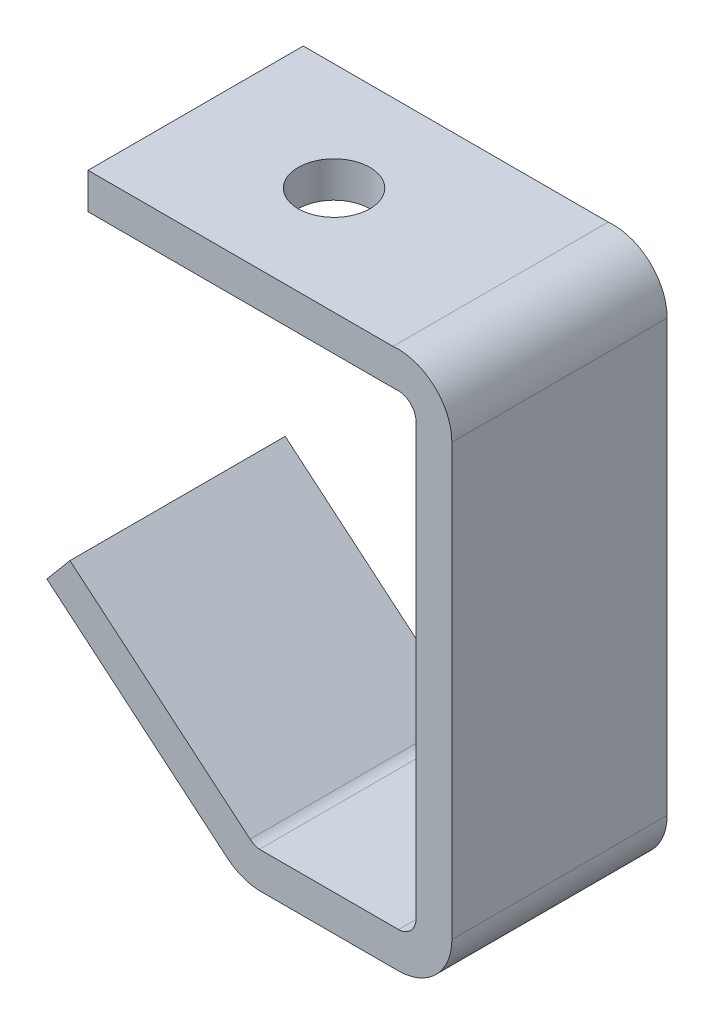
ISO-10303-21;
HEADER;
FILE_DESCRIPTION(('STEP AP214'),'2;1');
FILE_NAME('part.step','',(''),(''),'','','');
FILE_SCHEMA(('AUTOMOTIVE_DESIGN { 1 0 10303 214 1 1 1 1 }'));
ENDSEC;
DATA;
#1=APPLICATION_CONTEXT('core data for automotive mechanical design processes');
#2=APPLICATION_PROTOCOL_DEFINITION('international standard','automotive_design',2000,#1);
#3=PRODUCT_CONTEXT('',#1,'mechanical');
#4=PRODUCT('Part','Part','',(#3));
#5=PRODUCT_RELATED_PRODUCT_CATEGORY('part','',(#4));
#6=PRODUCT_DEFINITION_FORMATION('','',#4);
#7=PRODUCT_DEFINITION_CONTEXT('part definition',#1,'design');
#8=PRODUCT_DEFINITION('design','',#6,#7);
#9=PRODUCT_DEFINITION_SHAPE('','',#8);
#10=(LENGTH_UNIT() NAMED_UNIT(*) SI_UNIT(.MILLI.,.METRE.));
#11=(NAMED_UNIT(*) PLANE_ANGLE_UNIT() SI_UNIT($,.RADIAN.));
#12=(NAMED_UNIT(*) SI_UNIT($,.STERADIAN.) SOLID_ANGLE_UNIT());
#13=UNCERTAINTY_MEASURE_WITH_UNIT(LENGTH_MEASURE(1.E-05),#10,'distance_accuracy_value','');
#14=(GEOMETRIC_REPRESENTATION_CONTEXT(3) GLOBAL_UNCERTAINTY_ASSIGNED_CONTEXT((#13)) GLOBAL_UNIT_ASSIGNED_CONTEXT((#10,
#11,#12)) REPRESENTATION_CONTEXT('',''));
#15=CARTESIAN_POINT('',(0.,0.,0.));
#16=DIRECTION('',(0.,0.,1.));
#17=DIRECTION('',(1.,0.,0.));
#18=AXIS2_PLACEMENT_3D('',#15,#16,#17);
#19=CARTESIAN_POINT('',(0.,0.,38.1));
#20=DIRECTION('',(1.,0.,0.));
#21=DIRECTION('',(0.,0.,-1.));
#22=AXIS2_PLACEMENT_3D('',#19,#20,#21);
#23=PLANE('',#22);
#24=DIRECTION('',(0.,-1.,0.));
#25=VECTOR('',#24,1.);
#26=CARTESIAN_POINT('',(0.,0.,0.));
#27=LINE('',#26,#25);
#28=CARTESIAN_POINT('',(0.,0.,0.));
#29=VERTEX_POINT('',#28);
#30=CARTESIAN_POINT('',(0.,-6.35,0.));
#31=VERTEX_POINT('',#30);
#32=EDGE_CURVE('E177',#29,#31,#27,.T.);
#33=ORIENTED_EDGE('',*,*,#32,.T.);
#34=DIRECTION('',(0.,0.,-1.));
#35=VECTOR('',#34,1.);
#36=CARTESIAN_POINT('',(0.,-6.35,38.1));
#37=LINE('',#36,#35);
#38=CARTESIAN_POINT('',(0.,-6.35,38.1));
#39=VERTEX_POINT('',#38);
#40=EDGE_CURVE('E11',#39,#31,#37,.T.);
#41=ORIENTED_EDGE('',*,*,#40,.F.);
#42=DIRECTION('',(0.,-1.,0.));
#43=VECTOR('',#42,1.);
#44=CARTESIAN_POINT('',(0.,0.,38.1));
#45=LINE('',#44,#43);
#46=CARTESIAN_POINT('',(0.,0.,38.1));
#47=VERTEX_POINT('',#46);
#48=EDGE_CURVE('E208',#47,#39,#45,.T.);
#49=ORIENTED_EDGE('',*,*,#48,.F.);
#50=DIRECTION('',(0.,0.,-1.));
#51=VECTOR('',#50,1.);
#52=CARTESIAN_POINT('',(0.,0.,38.1));
#53=LINE('',#52,#51);
#54=EDGE_CURVE('E173',#47,#29,#53,.T.);
#55=ORIENTED_EDGE('',*,*,#54,.T.);
#56=EDGE_LOOP('',(#33,#41,#49,#55));
#57=FACE_BOUND('',#56,.T.);
#58=ADVANCED_FACE('F33',(#57),#23,.F.);
#59=CARTESIAN_POINT('',(0.,-6.35,38.1));
#60=DIRECTION('',(0.,1.,0.));
#61=DIRECTION('',(0.,0.,1.));
#62=AXIS2_PLACEMENT_3D('',#59,#60,#61);
#63=PLANE('',#62);
#64=CARTESIAN_POINT('',(24.5,-6.35,19.05));
#65=DIRECTION('',(0.,1.,0.));
#66=DIRECTION('',(0.,0.,1.));
#67=AXIS2_PLACEMENT_3D('',#64,#65,#66);
#68=CIRCLE('',#67,6.35);
#69=CARTESIAN_POINT('',(24.5,-6.35,25.4));
#70=VERTEX_POINT('',#69);
#71=EDGE_CURVE('E181',#70,#70,#68,.T.);
#72=ORIENTED_EDGE('',*,*,#71,.T.);
#73=EDGE_LOOP('',(#72));
#74=FACE_BOUND('',#73,.T.);
#75=DIRECTION('',(1.,0.,0.));
#76=VECTOR('',#75,1.);
#77=CARTESIAN_POINT('',(0.,-6.35,0.));
#78=LINE('',#77,#76);
#79=CARTESIAN_POINT('',(54.3575952516479,-6.35,0.));
#80=VERTEX_POINT('',#79);
#81=EDGE_CURVE('E180',#31,#80,#78,.T.);
#82=ORIENTED_EDGE('',*,*,#81,.T.);
#83=DIRECTION('',(0.,0.,-1.));
#84=VECTOR('',#83,1.);
#85=CARTESIAN_POINT('',(54.3575952516479,-6.35,38.1));
#86=LINE('',#85,#84);
#87=CARTESIAN_POINT('',(54.3575952516479,-6.35,38.1));
#88=VERTEX_POINT('',#87);
#89=EDGE_CURVE('E41',#88,#80,#86,.T.);
#90=ORIENTED_EDGE('',*,*,#89,.F.);
#91=DIRECTION('',(1.,0.,0.));
#92=VECTOR('',#91,1.);
#93=CARTESIAN_POINT('',(0.,-6.35,38.1));
#94=LINE('',#93,#92);
#95=EDGE_CURVE('E116',#39,#88,#94,.T.);
#96=ORIENTED_EDGE('',*,*,#95,.F.);
#97=ORIENTED_EDGE('',*,*,#40,.T.);
#98=EDGE_LOOP('',(#82,#90,#96,#97));
#99=FACE_BOUND('',#98,.T.);
#100=ADVANCED_FACE('F308',(#74,#99),#63,.F.);
#101=CARTESIAN_POINT('',(54.8713637428796,-9.48822273546947,38.1));
#102=DIRECTION('',(0.,0.,-1.));
#103=DIRECTION('',(-1.,0.,0.));
#104=AXIS2_PLACEMENT_3D('',#101,#102,#103);
#105=CYLINDRICAL_SURFACE('',#104,3.17999999999999);
#106=CARTESIAN_POINT('',(54.8713637428796,-9.48822273546947,0.));
#107=DIRECTION('',(0.,0.,-1.));
#108=DIRECTION('',(-1.,0.,0.));
#109=AXIS2_PLACEMENT_3D('',#106,#107,#108);
#110=CIRCLE('',#109,3.17999999999999);
#111=CARTESIAN_POINT('',(58.0513637428795,-9.48822273546947,0.));
#112=VERTEX_POINT('',#111);
#113=EDGE_CURVE('E183',#80,#112,#110,.T.);
#114=ORIENTED_EDGE('',*,*,#113,.T.);
#115=DIRECTION('',(0.,0.,-1.));
#116=VECTOR('',#115,1.);
#117=CARTESIAN_POINT('',(58.0513637428795,-9.48822273546947,38.1));
#118=LINE('',#117,#116);
#119=CARTESIAN_POINT('',(58.0513637428795,-9.48822273546947,38.1));
#120=VERTEX_POINT('',#119);
#121=EDGE_CURVE('E239',#120,#112,#118,.T.);
#122=ORIENTED_EDGE('',*,*,#121,.F.);
#123=CARTESIAN_POINT('',(54.8713637428796,-9.48822273546947,38.1));
#124=DIRECTION('',(0.,0.,-1.));
#125=DIRECTION('',(-1.,0.,0.));
#126=AXIS2_PLACEMENT_3D('',#123,#124,#125);
#127=CIRCLE('',#126,3.17999999999999);
#128=EDGE_CURVE('E247',#88,#120,#127,.T.);
#129=ORIENTED_EDGE('',*,*,#128,.F.);
#130=ORIENTED_EDGE('',*,*,#89,.T.);
#131=EDGE_LOOP('',(#114,#122,#129,#130));
#132=FACE_BOUND('',#131,.T.);
#133=ADVANCED_FACE('F245',(#132),#105,.F.);
#134=CARTESIAN_POINT('',(58.0513637428795,-9.48822273546947,38.1));
#135=DIRECTION('',(1.,0.,0.));
#136=DIRECTION('',(0.,1.,0.));
#137=AXIS2_PLACEMENT_3D('',#134,#135,#136);
#138=PLANE('',#137);
#139=DIRECTION('',(0.,-1.,0.));
#140=VECTOR('',#139,1.);
#141=CARTESIAN_POINT('',(58.0513637428795,-9.48822273546947,0.));
#142=LINE('',#141,#140);
#143=CARTESIAN_POINT('',(58.0513637428795,-85.7212405559481,0.));
#144=VERTEX_POINT('',#143);
#145=EDGE_CURVE('E185',#112,#144,#142,.T.);
#146=ORIENTED_EDGE('',*,*,#145,.T.);
#147=DIRECTION('',(0.,0.,-1.));
#148=VECTOR('',#147,1.);
#149=CARTESIAN_POINT('',(58.0513637428795,-85.7212405559481,38.1));
#150=LINE('',#149,#148);
#151=CARTESIAN_POINT('',(58.0513637428795,-85.7212405559481,38.1));
#152=VERTEX_POINT('',#151);
#153=EDGE_CURVE('E236',#152,#144,#150,.T.);
#154=ORIENTED_EDGE('',*,*,#153,.F.);
#155=DIRECTION('',(0.,-1.,0.));
#156=VECTOR('',#155,1.);
#157=CARTESIAN_POINT('',(58.0513637428795,-9.48822273546947,38.1));
#158=LINE('',#157,#156);
#159=EDGE_CURVE('E265',#120,#152,#158,.T.);
#160=ORIENTED_EDGE('',*,*,#159,.F.);
#161=ORIENTED_EDGE('',*,*,#121,.T.);
#162=EDGE_LOOP('',(#146,#154,#160,#161));
#163=FACE_BOUND('',#162,.T.);
#164=ADVANCED_FACE('F256',(#163),#138,.F.);
#165=CARTESIAN_POINT('',(54.8713637428796,-85.7212405559481,38.1));
#166=DIRECTION('',(0.,0.,-1.));
#167=DIRECTION('',(-1.,0.,0.));
#168=AXIS2_PLACEMENT_3D('',#165,#166,#167);
#169=CYLINDRICAL_SURFACE('',#168,3.17999999999998);
#170=CARTESIAN_POINT('',(54.8713637428796,-85.7212405559481,0.));
#171=DIRECTION('',(0.,0.,-1.));
#172=DIRECTION('',(-1.,0.,0.));
#173=AXIS2_PLACEMENT_3D('',#170,#171,#172);
#174=CIRCLE('',#173,3.17999999999998);
#175=CARTESIAN_POINT('',(54.9601803902528,-88.9,0.));
#176=VERTEX_POINT('',#175);
#177=EDGE_CURVE('E187',#144,#176,#174,.T.);
#178=ORIENTED_EDGE('',*,*,#177,.T.);
#179=DIRECTION('',(0.,0.,-1.));
#180=VECTOR('',#179,1.);
#181=CARTESIAN_POINT('',(54.9601803902528,-88.9,38.1));
#182=LINE('',#181,#180);
#183=CARTESIAN_POINT('',(54.9601803902528,-88.9,38.1));
#184=VERTEX_POINT('',#183);
#185=EDGE_CURVE('E233',#184,#176,#182,.T.);
#186=ORIENTED_EDGE('',*,*,#185,.F.);
#187=CARTESIAN_POINT('',(54.8713637428796,-85.7212405559481,38.1));
#188=DIRECTION('',(0.,0.,-1.));
#189=DIRECTION('',(-1.,0.,0.));
#190=AXIS2_PLACEMENT_3D('',#187,#188,#189);
#191=CIRCLE('',#190,3.17999999999998);
#192=EDGE_CURVE('E262',#152,#184,#191,.T.);
#193=ORIENTED_EDGE('',*,*,#192,.F.);
#194=ORIENTED_EDGE('',*,*,#153,.T.);
#195=EDGE_LOOP('',(#178,#186,#193,#194));
#196=FACE_BOUND('',#195,.T.);
#197=ADVANCED_FACE('F260',(#196),#169,.F.);
#198=CARTESIAN_POINT('',(54.9601803902528,-88.9,38.1));
#199=DIRECTION('',(0.,-1.,0.));
#200=DIRECTION('',(0.,0.,-1.));
#201=AXIS2_PLACEMENT_3D('',#198,#199,#200);
#202=PLANE('',#201);
#203=DIRECTION('',(-1.,0.,0.));
#204=VECTOR('',#203,1.);
#205=CARTESIAN_POINT('',(54.9601803902528,-88.9,0.));
#206=LINE('',#205,#204);
#207=CARTESIAN_POINT('',(30.3490624669277,-88.9,0.));
#208=VERTEX_POINT('',#207);
#209=EDGE_CURVE('E189',#176,#208,#206,.T.);
#210=ORIENTED_EDGE('',*,*,#209,.T.);
#211=DIRECTION('',(0.,0.,-1.));
#212=VECTOR('',#211,1.);
#213=CARTESIAN_POINT('',(30.3490624669277,-88.9,38.1));
#214=LINE('',#213,#212);
#215=CARTESIAN_POINT('',(30.3490624669277,-88.9,38.1));
#216=VERTEX_POINT('',#215);
#217=EDGE_CURVE('E230',#216,#208,#214,.T.);
#218=ORIENTED_EDGE('',*,*,#217,.F.);
#219=DIRECTION('',(-1.,0.,0.));
#220=VECTOR('',#219,1.);
#221=CARTESIAN_POINT('',(54.9601803902528,-88.9,38.1));
#222=LINE('',#221,#220);
#223=EDGE_CURVE('E264',#184,#216,#222,.T.);
#224=ORIENTED_EDGE('',*,*,#223,.F.);
#225=ORIENTED_EDGE('',*,*,#185,.T.);
#226=EDGE_LOOP('',(#210,#218,#224,#225));
#227=FACE_BOUND('',#226,.T.);
#228=ADVANCED_FACE('F323',(#227),#202,.F.);
#229=CARTESIAN_POINT('',(30.7278652692855,-85.7426421747091,38.1));
#230=DIRECTION('',(0.,0.,-1.));
#231=DIRECTION('',(-1.,0.,0.));
#232=AXIS2_PLACEMENT_3D('',#229,#230,#231);
#233=CYLINDRICAL_SURFACE('',#232,3.18000000000001);
#234=CARTESIAN_POINT('',(30.7278652692855,-85.7426421747091,0.));
#235=DIRECTION('',(0.,0.,-1.));
#236=DIRECTION('',(-1.,0.,0.));
#237=AXIS2_PLACEMENT_3D('',#234,#235,#236);
#238=CIRCLE('',#237,3.18000000000001);
#239=CARTESIAN_POINT('',(28.6838006704823,-88.1786635038274,0.));
#240=VERTEX_POINT('',#239);
#241=EDGE_CURVE('E191',#208,#240,#238,.T.);
#242=ORIENTED_EDGE('',*,*,#241,.T.);
#243=DIRECTION('',(0.,0.,-1.));
#244=VECTOR('',#243,1.);
#245=CARTESIAN_POINT('',(28.6838006704823,-88.1786635038274,38.1));
#246=LINE('',#245,#244);
#247=CARTESIAN_POINT('',(28.6838006704823,-88.1786635038274,38.1));
#248=VERTEX_POINT('',#247);
#249=EDGE_CURVE('E227',#248,#240,#246,.T.);
#250=ORIENTED_EDGE('',*,*,#249,.F.);
#251=CARTESIAN_POINT('',(30.7278652692855,-85.7426421747091,38.1));
#252=DIRECTION('',(0.,0.,-1.));
#253=DIRECTION('',(-1.,0.,0.));
#254=AXIS2_PLACEMENT_3D('',#251,#252,#253);
#255=CIRCLE('',#254,3.18000000000001);
#256=EDGE_CURVE('E267',#216,#248,#255,.T.);
#257=ORIENTED_EDGE('',*,*,#256,.F.);
#258=ORIENTED_EDGE('',*,*,#217,.T.);
#259=EDGE_LOOP('',(#242,#250,#257,#258));
#260=FACE_BOUND('',#259,.T.);
#261=ADVANCED_FACE('F326',(#260),#233,.F.);
#262=CARTESIAN_POINT('',(28.6838006704823,-88.1786635038274,38.1));
#263=DIRECTION('',(-0.64278760968654,-0.766044443118977,0.));
#264=DIRECTION('',(0.766044443118977,-0.64278760968654,0.));
#265=AXIS2_PLACEMENT_3D('',#262,#263,#264);
#266=PLANE('',#265);
#267=DIRECTION('',(-0.766044443118977,0.64278760968654,0.));
#268=VECTOR('',#267,1.);
#269=CARTESIAN_POINT('',(28.6838006704823,-88.1786635038274,0.));
#270=LINE('',#269,#268);
#271=CARTESIAN_POINT('',(-3.19896905212954,-61.4258431886736,0.));
#272=VERTEX_POINT('',#271);
#273=EDGE_CURVE('E193',#240,#272,#270,.T.);
#274=ORIENTED_EDGE('',*,*,#273,.T.);
#275=DIRECTION('',(0.,0.,-1.));
#276=VECTOR('',#275,1.);
#277=CARTESIAN_POINT('',(-3.19896905212954,-61.4258431886736,38.1));
#278=LINE('',#277,#276);
#279=CARTESIAN_POINT('',(-3.19896905212954,-61.4258431886736,38.1));
#280=VERTEX_POINT('',#279);
#281=EDGE_CURVE('E224',#280,#272,#278,.T.);
#282=ORIENTED_EDGE('',*,*,#281,.F.);
#283=DIRECTION('',(-0.766044443118977,0.64278760968654,0.));
#284=VECTOR('',#283,1.);
#285=CARTESIAN_POINT('',(28.6838006704823,-88.1786635038274,38.1));
#286=LINE('',#285,#284);
#287=EDGE_CURVE('E273',#248,#280,#286,.T.);
#288=ORIENTED_EDGE('',*,*,#287,.F.);
#289=ORIENTED_EDGE('',*,*,#249,.T.);
#290=EDGE_LOOP('',(#274,#282,#288,#289));
#291=FACE_BOUND('',#290,.T.);
#292=ADVANCED_FACE('F330',(#291),#266,.F.);
#293=CARTESIAN_POINT('',(-3.19896905212954,-61.4258431886736,38.1));
#294=DIRECTION('',(0.766044443118977,-0.64278760968654,0.));
#295=DIRECTION('',(0.64278760968654,0.766044443118977,0.));
#296=AXIS2_PLACEMENT_3D('',#293,#294,#295);
#297=PLANE('',#296);
#298=DIRECTION('',(-0.64278760968654,-0.766044443118977,0.));
#299=VECTOR('',#298,1.);
#300=CARTESIAN_POINT('',(-3.19896905212954,-61.4258431886736,0.));
#301=LINE('',#300,#299);
#302=CARTESIAN_POINT('',(-7.28067037363907,-66.2902254024791,0.));
#303=VERTEX_POINT('',#302);
#304=EDGE_CURVE('E195',#272,#303,#301,.T.);
#305=ORIENTED_EDGE('',*,*,#304,.T.);
#306=DIRECTION('',(0.,0.,-1.));
#307=VECTOR('',#306,1.);
#308=CARTESIAN_POINT('',(-7.28067037363907,-66.2902254024791,38.1));
#309=LINE('',#308,#307);
#310=CARTESIAN_POINT('',(-7.28067037363907,-66.2902254024791,38.1));
#311=VERTEX_POINT('',#310);
#312=EDGE_CURVE('E221',#311,#303,#309,.T.);
#313=ORIENTED_EDGE('',*,*,#312,.F.);
#314=DIRECTION('',(-0.64278760968654,-0.766044443118977,0.));
#315=VECTOR('',#314,1.);
#316=CARTESIAN_POINT('',(-3.19896905212954,-61.4258431886736,38.1));
#317=LINE('',#316,#315);
#318=EDGE_CURVE('E275',#280,#311,#317,.T.);
#319=ORIENTED_EDGE('',*,*,#318,.F.);
#320=ORIENTED_EDGE('',*,*,#281,.T.);
#321=EDGE_LOOP('',(#305,#313,#319,#320));
#322=FACE_BOUND('',#321,.T.);
#323=ADVANCED_FACE('F334',(#322),#297,.F.);
#324=CARTESIAN_POINT('',(24.6020993489728,-93.0430457176329,38.1));
#325=DIRECTION('',(0.642787609686541,0.766044443118977,0.));
#326=DIRECTION('',(-0.766044443118977,0.642787609686541,0.));
#327=AXIS2_PLACEMENT_3D('',#324,#325,#326);
#328=PLANE('',#327);
#329=DIRECTION('',(0.766044443118977,-0.642787609686541,0.));
#330=VECTOR('',#329,1.);
#331=CARTESIAN_POINT('',(24.6020993489728,-93.0430457176329,0.));
#332=LINE('',#331,#330);
#333=CARTESIAN_POINT('',(24.6020993489728,-93.0430457176329,0.));
#334=VERTEX_POINT('',#333);
#335=EDGE_CURVE('E197',#303,#334,#332,.T.);
#336=ORIENTED_EDGE('',*,*,#335,.T.);
#337=DIRECTION('',(0.,0.,-1.));
#338=VECTOR('',#337,1.);
#339=CARTESIAN_POINT('',(24.6020993489728,-93.0430457176329,38.1));
#340=LINE('',#339,#338);
#341=CARTESIAN_POINT('',(24.6020993489728,-93.0430457176329,38.1));
#342=VERTEX_POINT('',#341);
#343=EDGE_CURVE('E218',#342,#334,#340,.T.);
#344=ORIENTED_EDGE('',*,*,#343,.F.);
#345=DIRECTION('',(0.766044443118977,-0.642787609686541,0.));
#346=VECTOR('',#345,1.);
#347=CARTESIAN_POINT('',(24.6020993489728,-93.0430457176329,38.1));
#348=LINE('',#347,#346);
#349=EDGE_CURVE('E277',#311,#342,#348,.T.);
#350=ORIENTED_EDGE('',*,*,#349,.F.);
#351=ORIENTED_EDGE('',*,*,#312,.T.);
#352=EDGE_LOOP('',(#336,#344,#350,#351));
#353=FACE_BOUND('',#352,.T.);
#354=ADVANCED_FACE('F338',(#353),#328,.F.);
#355=CARTESIAN_POINT('',(30.7278652692855,-85.7426421747091,38.1));
#356=DIRECTION('',(0.,0.,-1.));
#357=DIRECTION('',(-1.,0.,0.));
#358=AXIS2_PLACEMENT_3D('',#355,#356,#357);
#359=CYLINDRICAL_SURFACE('',#358,9.53000000000001);
#360=CARTESIAN_POINT('',(30.7278652692855,-85.7426421747091,0.));
#361=DIRECTION('',(0.,0.,1.));
#362=DIRECTION('',(-1.,0.,0.));
#363=AXIS2_PLACEMENT_3D('',#360,#361,#362);
#364=CIRCLE('',#363,9.53000000000001);
#365=CARTESIAN_POINT('',(30.0713234336961,-95.25,0.));
#366=VERTEX_POINT('',#365);
#367=EDGE_CURVE('E199',#334,#366,#364,.T.);
#368=ORIENTED_EDGE('',*,*,#367,.T.);
#369=DIRECTION('',(0.,0.,-1.));
#370=VECTOR('',#369,1.);
#371=CARTESIAN_POINT('',(30.0713234336961,-95.25,38.1));
#372=LINE('',#371,#370);
#373=CARTESIAN_POINT('',(30.0713234336961,-95.25,38.1));
#374=VERTEX_POINT('',#373);
#375=EDGE_CURVE('E215',#374,#366,#372,.T.);
#376=ORIENTED_EDGE('',*,*,#375,.F.);
#377=CARTESIAN_POINT('',(30.7278652692855,-85.7426421747091,38.1));
#378=DIRECTION('',(0.,0.,1.));
#379=DIRECTION('',(-1.,0.,0.));
#380=AXIS2_PLACEMENT_3D('',#377,#378,#379);
#381=CIRCLE('',#380,9.53000000000001);
#382=EDGE_CURVE('E279',#342,#374,#381,.T.);
#383=ORIENTED_EDGE('',*,*,#382,.F.);
#384=ORIENTED_EDGE('',*,*,#343,.T.);
#385=EDGE_LOOP('',(#368,#376,#383,#384));
#386=FACE_BOUND('',#385,.T.);
#387=ADVANCED_FACE('F342',(#386),#359,.T.);
#388=CARTESIAN_POINT('',(55.0251280345445,-95.25,38.1));
#389=DIRECTION('',(0.,1.,0.));
#390=DIRECTION('',(0.,0.,1.));
#391=AXIS2_PLACEMENT_3D('',#388,#389,#390);
#392=PLANE('',#391);
#393=DIRECTION('',(1.,0.,0.));
#394=VECTOR('',#393,1.);
#395=CARTESIAN_POINT('',(55.0251280345445,-95.25,0.));
#396=LINE('',#395,#394);
#397=CARTESIAN_POINT('',(55.0251280345445,-95.25,0.));
#398=VERTEX_POINT('',#397);
#399=EDGE_CURVE('E201',#366,#398,#396,.T.);
#400=ORIENTED_EDGE('',*,*,#399,.T.);
#401=DIRECTION('',(0.,0.,-1.));
#402=VECTOR('',#401,1.);
#403=CARTESIAN_POINT('',(55.0251280345445,-95.25,38.1));
#404=LINE('',#403,#402);
#405=CARTESIAN_POINT('',(55.0251280345445,-95.25,38.1));
#406=VERTEX_POINT('',#405);
#407=EDGE_CURVE('E212',#406,#398,#404,.T.);
#408=ORIENTED_EDGE('',*,*,#407,.F.);
#409=DIRECTION('',(1.,0.,0.));
#410=VECTOR('',#409,1.);
#411=CARTESIAN_POINT('',(55.0251280345445,-95.25,38.1));
#412=LINE('',#411,#410);
#413=EDGE_CURVE('E281',#374,#406,#412,.T.);
#414=ORIENTED_EDGE('',*,*,#413,.F.);
#415=ORIENTED_EDGE('',*,*,#375,.T.);
#416=EDGE_LOOP('',(#400,#408,#414,#415));
#417=FACE_BOUND('',#416,.T.);
#418=ADVANCED_FACE('F287',(#417),#392,.F.);
#419=CARTESIAN_POINT('',(54.8713637428796,-85.7212405559481,38.1));
#420=DIRECTION('',(0.,0.,-1.));
#421=DIRECTION('',(-1.,0.,0.));
#422=AXIS2_PLACEMENT_3D('',#419,#420,#421);
#423=CYLINDRICAL_SURFACE('',#422,9.53);
#424=CARTESIAN_POINT('',(54.8713637428796,-85.7212405559481,0.));
#425=DIRECTION('',(0.,0.,1.));
#426=DIRECTION('',(-1.,0.,0.));
#427=AXIS2_PLACEMENT_3D('',#424,#425,#426);
#428=CIRCLE('',#427,9.53);
#429=CARTESIAN_POINT('',(64.4013637428796,-85.7212405559481,0.));
#430=VERTEX_POINT('',#429);
#431=EDGE_CURVE('E203',#398,#430,#428,.T.);
#432=ORIENTED_EDGE('',*,*,#431,.T.);
#433=DIRECTION('',(0.,0.,-1.));
#434=VECTOR('',#433,1.);
#435=CARTESIAN_POINT('',(64.4013637428796,-85.7212405559481,38.1));
#436=LINE('',#435,#434);
#437=CARTESIAN_POINT('',(64.4013637428796,-85.7212405559481,38.1));
#438=VERTEX_POINT('',#437);
#439=EDGE_CURVE('E168',#438,#430,#436,.T.);
#440=ORIENTED_EDGE('',*,*,#439,.F.);
#441=CARTESIAN_POINT('',(54.8713637428796,-85.7212405559481,38.1));
#442=DIRECTION('',(0.,0.,1.));
#443=DIRECTION('',(-1.,0.,0.));
#444=AXIS2_PLACEMENT_3D('',#441,#442,#443);
#445=CIRCLE('',#444,9.53);
#446=EDGE_CURVE('E159',#406,#438,#445,.T.);
#447=ORIENTED_EDGE('',*,*,#446,.F.);
#448=ORIENTED_EDGE('',*,*,#407,.T.);
#449=EDGE_LOOP('',(#432,#440,#447,#448));
#450=FACE_BOUND('',#449,.T.);
#451=ADVANCED_FACE('F291',(#450),#423,.T.);
#452=CARTESIAN_POINT('',(64.4013637428795,-9.48822273546947,38.1));
#453=DIRECTION('',(-1.,0.,0.));
#454=DIRECTION('',(0.,-1.,0.));
#455=AXIS2_PLACEMENT_3D('',#452,#453,#454);
#456=PLANE('',#455);
#457=DIRECTION('',(0.,1.,0.));
#458=VECTOR('',#457,1.);
#459=CARTESIAN_POINT('',(64.4013637428795,-9.48822273546947,0.));
#460=LINE('',#459,#458);
#461=CARTESIAN_POINT('',(64.4013637428795,-9.48822273546947,0.));
#462=VERTEX_POINT('',#461);
#463=EDGE_CURVE('E167',#430,#462,#460,.T.);
#464=ORIENTED_EDGE('',*,*,#463,.T.);
#465=DIRECTION('',(0.,0.,-1.));
#466=VECTOR('',#465,1.);
#467=CARTESIAN_POINT('',(64.4013637428795,-9.48822273546947,38.1));
#468=LINE('',#467,#466);
#469=CARTESIAN_POINT('',(64.4013637428795,-9.48822273546947,38.1));
#470=VERTEX_POINT('',#469);
#471=EDGE_CURVE('E164',#470,#462,#468,.T.);
#472=ORIENTED_EDGE('',*,*,#471,.F.);
#473=DIRECTION('',(0.,1.,0.));
#474=VECTOR('',#473,1.);
#475=CARTESIAN_POINT('',(64.4013637428795,-9.48822273546947,38.1));
#476=LINE('',#475,#474);
#477=EDGE_CURVE('E153',#438,#470,#476,.T.);
#478=ORIENTED_EDGE('',*,*,#477,.F.);
#479=ORIENTED_EDGE('',*,*,#439,.T.);
#480=EDGE_LOOP('',(#464,#472,#478,#479));
#481=FACE_BOUND('',#480,.T.);
#482=ADVANCED_FACE('F165',(#481),#456,.F.);
#483=CARTESIAN_POINT('',(54.8713637428796,-9.48822273546947,38.1));
#484=DIRECTION('',(0.,0.,-1.));
#485=DIRECTION('',(-1.,0.,0.));
#486=AXIS2_PLACEMENT_3D('',#483,#484,#485);
#487=CYLINDRICAL_SURFACE('',#486,9.52999999999999);
#488=CARTESIAN_POINT('',(54.8713637428796,-9.48822273546947,0.));
#489=DIRECTION('',(0.,0.,1.));
#490=DIRECTION('',(-1.,0.,0.));
#491=AXIS2_PLACEMENT_3D('',#488,#489,#490);
#492=CIRCLE('',#491,9.52999999999999);
#493=CARTESIAN_POINT('',(53.98,0.,0.));
#494=VERTEX_POINT('',#493);
#495=EDGE_CURVE('E102',#462,#494,#492,.T.);
#496=ORIENTED_EDGE('',*,*,#495,.T.);
#497=DIRECTION('',(0.,0.,-1.));
#498=VECTOR('',#497,1.);
#499=CARTESIAN_POINT('',(53.98,0.,38.1));
#500=LINE('',#499,#498);
#501=CARTESIAN_POINT('',(53.98,0.,38.1));
#502=VERTEX_POINT('',#501);
#503=EDGE_CURVE('E169',#502,#494,#500,.T.);
#504=ORIENTED_EDGE('',*,*,#503,.F.);
#505=CARTESIAN_POINT('',(54.8713637428796,-9.48822273546947,38.1));
#506=DIRECTION('',(0.,0.,1.));
#507=DIRECTION('',(-1.,0.,0.));
#508=AXIS2_PLACEMENT_3D('',#505,#506,#507);
#509=CIRCLE('',#508,9.52999999999999);
#510=EDGE_CURVE('E157',#470,#502,#509,.T.);
#511=ORIENTED_EDGE('',*,*,#510,.F.);
#512=ORIENTED_EDGE('',*,*,#471,.T.);
#513=EDGE_LOOP('',(#496,#504,#511,#512));
#514=FACE_BOUND('',#513,.T.);
#515=ADVANCED_FACE('F171',(#514),#487,.T.);
#516=CARTESIAN_POINT('',(0.,0.,38.1));
#517=DIRECTION('',(0.,-1.,0.));
#518=DIRECTION('',(0.,0.,-1.));
#519=AXIS2_PLACEMENT_3D('',#516,#517,#518);
#520=PLANE('',#519);
#521=CARTESIAN_POINT('',(24.5,0.,19.05));
#522=DIRECTION('',(0.,1.,0.));
#523=DIRECTION('',(0.,0.,1.));
#524=AXIS2_PLACEMENT_3D('',#521,#522,#523);
#525=CIRCLE('',#524,6.35);
#526=CARTESIAN_POINT('',(24.5,0.,25.4));
#527=VERTEX_POINT('',#526);
#528=EDGE_CURVE('E399',#527,#527,#525,.T.);
#529=ORIENTED_EDGE('',*,*,#528,.F.);
#530=EDGE_LOOP('',(#529));
#531=FACE_BOUND('',#530,.T.);
#532=DIRECTION('',(-1.,0.,0.));
#533=VECTOR('',#532,1.);
#534=CARTESIAN_POINT('',(0.,0.,0.));
#535=LINE('',#534,#533);
#536=EDGE_CURVE('E108',#494,#29,#535,.T.);
#537=ORIENTED_EDGE('',*,*,#536,.T.);
#538=ORIENTED_EDGE('',*,*,#54,.F.);
#539=DIRECTION('',(-1.,0.,0.));
#540=VECTOR('',#539,1.);
#541=CARTESIAN_POINT('',(0.,0.,38.1));
#542=LINE('',#541,#540);
#543=EDGE_CURVE('E49',#502,#47,#542,.T.);
#544=ORIENTED_EDGE('',*,*,#543,.F.);
#545=ORIENTED_EDGE('',*,*,#503,.T.);
#546=EDGE_LOOP('',(#537,#538,#544,#545));
#547=FACE_BOUND('',#546,.T.);
#548=ADVANCED_FACE('F295',(#531,#547),#520,.F.);
#549=CARTESIAN_POINT('',(54.8713637428796,-9.48822273546947,38.1));
#550=DIRECTION('',(0.,0.,-1.));
#551=DIRECTION('',(-1.,0.,0.));
#552=AXIS2_PLACEMENT_3D('',#549,#550,#551);
#553=PLANE('',#552);
#554=ORIENTED_EDGE('',*,*,#48,.T.);
#555=ORIENTED_EDGE('',*,*,#95,.T.);
#556=ORIENTED_EDGE('',*,*,#128,.T.);
#557=ORIENTED_EDGE('',*,*,#159,.T.);
#558=ORIENTED_EDGE('',*,*,#192,.T.);
#559=ORIENTED_EDGE('',*,*,#223,.T.);
#560=ORIENTED_EDGE('',*,*,#256,.T.);
#561=ORIENTED_EDGE('',*,*,#287,.T.);
#562=ORIENTED_EDGE('',*,*,#318,.T.);
#563=ORIENTED_EDGE('',*,*,#349,.T.);
#564=ORIENTED_EDGE('',*,*,#382,.T.);
#565=ORIENTED_EDGE('',*,*,#413,.T.);
#566=ORIENTED_EDGE('',*,*,#446,.T.);
#567=ORIENTED_EDGE('',*,*,#477,.T.);
#568=ORIENTED_EDGE('',*,*,#510,.T.);
#569=ORIENTED_EDGE('',*,*,#543,.T.);
#570=EDGE_LOOP('',(#554,#555,#556,#557,#558,#559,#560,#561,#562,#563,#564,#565,#566,#567,#568,#569));
#571=FACE_BOUND('',#570,.T.);
#572=ADVANCED_FACE('F155',(#571),#553,.F.);
#573=CARTESIAN_POINT('',(54.8713637428796,-9.48822273546947,0.));
#574=DIRECTION('',(0.,0.,-1.));
#575=DIRECTION('',(-1.,0.,0.));
#576=AXIS2_PLACEMENT_3D('',#573,#574,#575);
#577=PLANE('',#576);
#578=ORIENTED_EDGE('',*,*,#32,.F.);
#579=ORIENTED_EDGE('',*,*,#536,.F.);
#580=ORIENTED_EDGE('',*,*,#495,.F.);
#581=ORIENTED_EDGE('',*,*,#463,.F.);
#582=ORIENTED_EDGE('',*,*,#431,.F.);
#583=ORIENTED_EDGE('',*,*,#399,.F.);
#584=ORIENTED_EDGE('',*,*,#367,.F.);
#585=ORIENTED_EDGE('',*,*,#335,.F.);
#586=ORIENTED_EDGE('',*,*,#304,.F.);
#587=ORIENTED_EDGE('',*,*,#273,.F.);
#588=ORIENTED_EDGE('',*,*,#241,.F.);
#589=ORIENTED_EDGE('',*,*,#209,.F.);
#590=ORIENTED_EDGE('',*,*,#177,.F.);
#591=ORIENTED_EDGE('',*,*,#145,.F.);
#592=ORIENTED_EDGE('',*,*,#113,.F.);
#593=ORIENTED_EDGE('',*,*,#81,.F.);
#594=EDGE_LOOP('',(#578,#579,#580,#581,#582,#583,#584,#585,#586,#587,#588,#589,#590,#591,#592,#593));
#595=FACE_BOUND('',#594,.T.);
#596=ADVANCED_FACE('F251',(#595),#577,.T.);
#597=CARTESIAN_POINT('',(24.5,-38.1,19.05));
#598=DIRECTION('',(0.,1.,0.));
#599=DIRECTION('',(0.,0.,1.));
#600=AXIS2_PLACEMENT_3D('',#597,#598,#599);
#601=CYLINDRICAL_SURFACE('',#600,6.35);
#602=ORIENTED_EDGE('',*,*,#528,.T.);
#603=EDGE_LOOP('',(#602));
#604=FACE_BOUND('',#603,.T.);
#605=ORIENTED_EDGE('',*,*,#71,.F.);
#606=EDGE_LOOP('',(#605));
#607=FACE_BOUND('',#606,.T.);
#608=ADVANCED_FACE('F375',(#604,#607),#601,.F.);
#609=CLOSED_SHELL('',(#58,#100,#133,#164,#197,#228,#261,#292,#323,#354,#387,#418,#451,#482,#515,
#548,#572,#596,#608));
#610=MANIFOLD_SOLID_BREP('B2',#609);
#611=ADVANCED_BREP_SHAPE_REPRESENTATION('',(#18,#610),#14);
#612=SHAPE_DEFINITION_REPRESENTATION(#9,#611);
ENDSEC;
END-ISO-10303-21;
